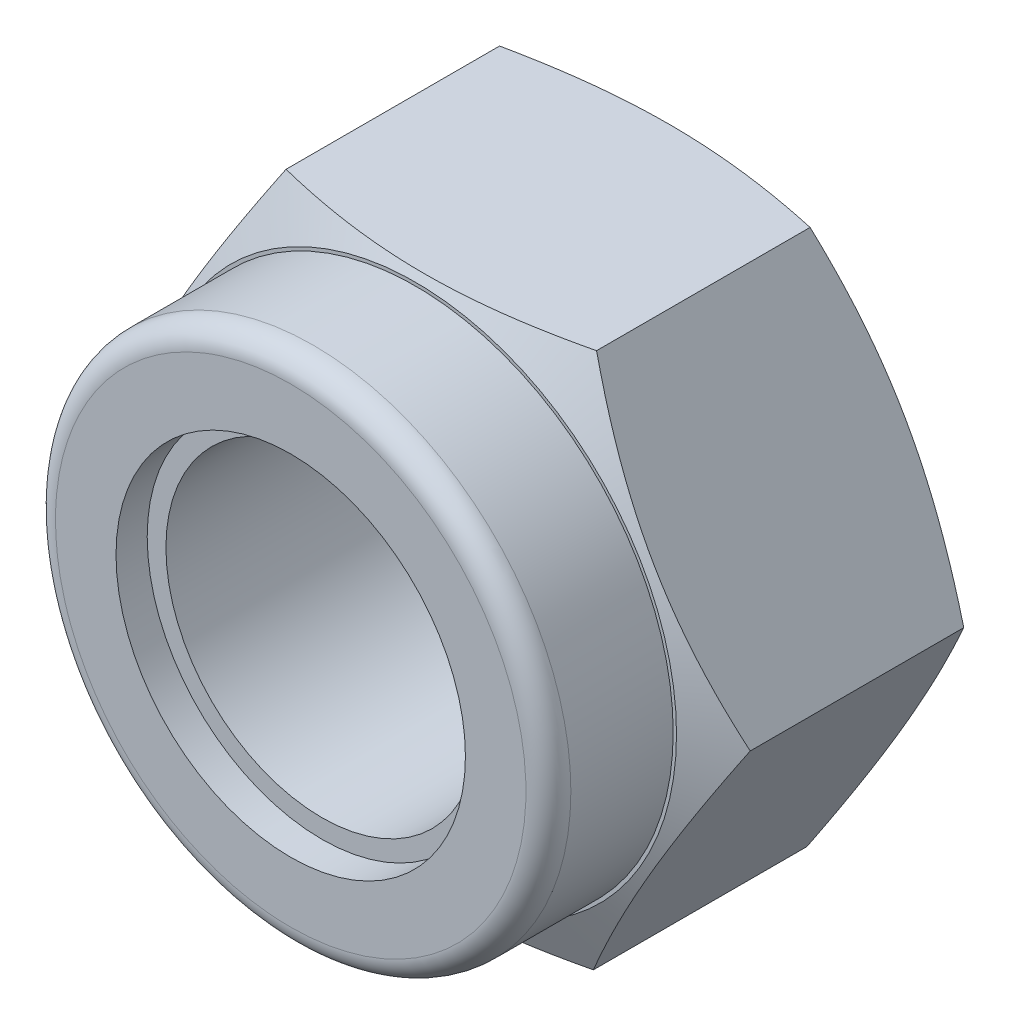
ISO-10303-21;
HEADER;
FILE_DESCRIPTION(('STEP AP214'),'2;1');
FILE_NAME('part.step','',(''),(''),'','','');
FILE_SCHEMA(('AUTOMOTIVE_DESIGN { 1 0 10303 214 1 1 1 1 }'));
ENDSEC;
DATA;
#1=APPLICATION_CONTEXT('core data for automotive mechanical design processes');
#2=APPLICATION_PROTOCOL_DEFINITION('international standard','automotive_design',2000,#1);
#3=PRODUCT_CONTEXT('',#1,'mechanical');
#4=PRODUCT('Part','Part','',(#3));
#5=PRODUCT_RELATED_PRODUCT_CATEGORY('part','',(#4));
#6=PRODUCT_DEFINITION_FORMATION('','',#4);
#7=PRODUCT_DEFINITION_CONTEXT('part definition',#1,'design');
#8=PRODUCT_DEFINITION('design','',#6,#7);
#9=PRODUCT_DEFINITION_SHAPE('','',#8);
#10=(LENGTH_UNIT() NAMED_UNIT(*) SI_UNIT(.MILLI.,.METRE.));
#11=(NAMED_UNIT(*) PLANE_ANGLE_UNIT() SI_UNIT($,.RADIAN.));
#12=(NAMED_UNIT(*) SI_UNIT($,.STERADIAN.) SOLID_ANGLE_UNIT());
#13=UNCERTAINTY_MEASURE_WITH_UNIT(LENGTH_MEASURE(1.E-05),#10,'distance_accuracy_value','');
#14=(GEOMETRIC_REPRESENTATION_CONTEXT(3) GLOBAL_UNCERTAINTY_ASSIGNED_CONTEXT((#13)) GLOBAL_UNIT_ASSIGNED_CONTEXT((#10,
#11,#12)) REPRESENTATION_CONTEXT('',''));
#15=CARTESIAN_POINT('',(0.,0.,0.));
#16=DIRECTION('',(0.,0.,1.));
#17=DIRECTION('',(1.,0.,0.));
#18=AXIS2_PLACEMENT_3D('',#15,#16,#17);
#19=CARTESIAN_POINT('',(0.,0.,5.334));
#20=DIRECTION('',(0.,0.,1.));
#21=DIRECTION('',(1.,0.,0.));
#22=AXIS2_PLACEMENT_3D('',#19,#20,#21);
#23=PLANE('',#22);
#24=CARTESIAN_POINT('',(0.,0.,5.33400000000736));
#25=DIRECTION('',(0.,0.,-1.));
#26=DIRECTION('',(-1.,0.,0.));
#27=AXIS2_PLACEMENT_3D('',#24,#25,#26);
#28=CIRCLE('',#27,5.31273775635555);
#29=CARTESIAN_POINT('',(-5.31273775635555,0.,5.33400000000736));
#30=VERTEX_POINT('',#29);
#31=EDGE_CURVE('E282',#30,#30,#28,.T.);
#32=ORIENTED_EDGE('',*,*,#31,.F.);
#33=EDGE_LOOP('',(#32));
#34=FACE_BOUND('',#33,.T.);
#35=CARTESIAN_POINT('',(0.,0.,5.334));
#36=DIRECTION('',(0.,0.,1.));
#37=DIRECTION('',(1.,0.,0.));
#38=AXIS2_PLACEMENT_3D('',#35,#36,#37);
#39=CIRCLE('',#38,5.2451);
#40=CARTESIAN_POINT('',(5.2451,0.,5.334));
#41=VERTEX_POINT('',#40);
#42=EDGE_CURVE('E21',#41,#41,#39,.T.);
#43=ORIENTED_EDGE('',*,*,#42,.F.);
#44=EDGE_LOOP('',(#43));
#45=FACE_BOUND('',#44,.T.);
#46=ADVANCED_FACE('F17',(#34,#45),#23,.T.);
#47=CARTESIAN_POINT('',(0.,0.,5.334));
#48=DIRECTION('',(0.,0.,1.));
#49=DIRECTION('',(1.,0.,0.));
#50=AXIS2_PLACEMENT_3D('',#47,#48,#49);
#51=CYLINDRICAL_SURFACE('',#50,5.2451);
#52=ORIENTED_EDGE('',*,*,#42,.T.);
#53=EDGE_LOOP('',(#52));
#54=FACE_BOUND('',#53,.T.);
#55=CARTESIAN_POINT('',(0.,0.,7.4168));
#56=DIRECTION('',(0.,0.,1.));
#57=DIRECTION('',(1.,0.,0.));
#58=AXIS2_PLACEMENT_3D('',#55,#56,#57);
#59=CIRCLE('',#58,5.2451);
#60=CARTESIAN_POINT('',(5.2451,0.,7.4168));
#61=VERTEX_POINT('',#60);
#62=EDGE_CURVE('E86',#61,#61,#59,.T.);
#63=ORIENTED_EDGE('',*,*,#62,.F.);
#64=EDGE_LOOP('',(#63));
#65=FACE_BOUND('',#64,.T.);
#66=ADVANCED_FACE('F119',(#54,#65),#51,.T.);
#67=CARTESIAN_POINT('',(0.,0.,4.83836780344404));
#68=DIRECTION('',(0.,0.,-1.));
#69=DIRECTION('',(-1.,0.,0.));
#70=AXIS2_PLACEMENT_3D('',#67,#68,#69);
#71=CONICAL_SURFACE('',#70,6.3265308160112,1.11607702485432);
#72=CARTESIAN_POINT('',(6.32037506594794,-0.0371655629206129,4.84132386008899));
#73=CARTESIAN_POINT('',(6.22833366151809,-0.19444286281713,4.8858660135372));
#74=CARTESIAN_POINT('',(6.13593989417938,-0.352322268768321,4.92769627799901));
#75=CARTESIAN_POINT('',(5.95043037166558,-0.669314789545201,5.00501655106751));
#76=CARTESIAN_POINT('',(5.85731426499188,-0.828428505000025,5.04050324073664));
#77=CARTESIAN_POINT('',(5.67031652629657,-1.14796404024023,5.10421314817306));
#78=CARTESIAN_POINT('',(5.57643405141017,-1.30838730028498,5.1324267923882));
#79=CARTESIAN_POINT('',(5.38814286869859,-1.63013302977098,5.18062149325364));
#80=CARTESIAN_POINT('',(5.29373425705883,-1.79145533485376,5.20060400767163));
#81=CARTESIAN_POINT('',(5.10662322282933,-2.11118446574603,5.23126731054475));
#82=CARTESIAN_POINT('',(5.01392905247022,-2.26957719041745,5.24214339050006));
#83=CARTESIAN_POINT('',(4.82837594477426,-2.58664418810835,5.25490604687276));
#84=CARTESIAN_POINT('',(4.73551699905818,-2.74531847544599,5.25679215221227));
#85=CARTESIAN_POINT('',(4.54996186341723,-3.06238893842205,5.25150045578435));
#86=CARTESIAN_POINT('',(4.4572656043928,-3.2207852321355,5.24433199570822));
#87=CARTESIAN_POINT('',(4.27216288236742,-3.53708262572682,5.22123078858181));
#88=CARTESIAN_POINT('',(4.17975639476994,-3.69498376763441,5.20529880682979));
#89=CARTESIAN_POINT('',(4.00714250371091,-3.98994066098654,5.16780955551947));
#90=CARTESIAN_POINT('',(3.92688014289494,-4.12709032173596,5.14722700506324));
#91=CARTESIAN_POINT('',(3.76677978044193,-4.40066451234116,5.10035283174324));
#92=CARTESIAN_POINT('',(3.68694180089308,-4.53708900445337,5.0740609146422));
#93=CARTESIAN_POINT('',(3.5269404443261,-4.81049401708344,5.01605322972002));
#94=CARTESIAN_POINT('',(3.44678193376816,-4.94746622195552,4.9842853299852));
#95=CARTESIAN_POINT('',(3.28699660715654,-5.22050208976119,4.91612438552128));
#96=CARTESIAN_POINT('',(3.20736961164292,-5.35656605935,4.87973299465746));
#97=CARTESIAN_POINT('',(3.12800121134054,-5.49218815001656,4.84132386008874));
#98=B_SPLINE_CURVE_WITH_KNOTS('',3,(#72,#73,#74,#75,#76,#77,#78,#79,#80,#81,#82,#83,#84,#85,#86,
#87,#88,#89,#90,#91,#92,#93,#94,#95,#96,#97),.UNSPECIFIED.,.F.,.F.,(4,2,2,2,2,2,2,2,2,2,2,2,4),
(0.,0.562813868194877,1.12592134237628,1.68976629638556,2.2535113481042,2.80483224896724,
3.35618203892448,3.90696345979255,4.45769678981567,4.93829687717906,5.41892173857439,
5.90440415872453,6.38971340373801),.UNSPECIFIED.);
#99=CARTESIAN_POINT('',(6.3203750659453,-0.0371655629146358,4.8413238600903));
#100=VERTEX_POINT('',#99);
#101=CARTESIAN_POINT('',(3.12800122281629,-5.49218815008425,4.84132385728342));
#102=VERTEX_POINT('',#101);
#103=EDGE_CURVE('E74',#100,#102,#98,.T.);
#104=ORIENTED_EDGE('',*,*,#103,.F.);
#105=CARTESIAN_POINT('',(3.19237385460845,5.45502258709762,4.84132386008864));
#106=CARTESIAN_POINT('',(3.28208512918141,5.29750628008782,4.88563179788484));
#107=CARTESIAN_POINT('',(3.37213784296513,5.13939046935004,4.92725624998518));
#108=CARTESIAN_POINT('',(3.55294266570987,4.82193084006841,5.00423596484944));
#109=CARTESIAN_POINT('',(3.64369510847837,4.66258643542072,5.0395880139036));
#110=CARTESIAN_POINT('',(3.8259485291596,4.34258333768004,5.10311689041716));
#111=CARTESIAN_POINT('',(3.91745035997898,4.18192314704165,5.13128385422299));
#112=CARTESIAN_POINT('',(4.1009666015464,3.85970277077768,5.17948424190754));
#113=CARTESIAN_POINT('',(4.19298092192724,3.69814274382008,5.19951905640176));
#114=CARTESIAN_POINT('',(4.3763064177163,3.3762572816539,5.23055252558859));
#115=CARTESIAN_POINT('',(4.46761329058068,3.21593940091178,5.24165376667182));
#116=CARTESIAN_POINT('',(4.65039373436749,2.89501094865245,5.25477402327016));
#117=CARTESIAN_POINT('',(4.74186731391235,2.73440036199585,5.25679255485539));
#118=CARTESIAN_POINT('',(4.92465602509764,2.41345739372297,5.25166678488675));
#119=CARTESIAN_POINT('',(5.01597122281918,2.25312489608054,5.24453194191376));
#120=CARTESIAN_POINT('',(5.19831553759308,1.93296220522435,5.2214010893566));
#121=CARTESIAN_POINT('',(5.2893446796386,1.77313196812721,5.20540587686116));
#122=CARTESIAN_POINT('',(5.45755507746106,1.47778580576614,5.16812128791714));
#123=CARTESIAN_POINT('',(5.53479875100708,1.34216028651277,5.14796055986878));
#124=CARTESIAN_POINT('',(5.68888070460646,1.07162104355403,5.10212452056477));
#125=CARTESIAN_POINT('',(5.76571899315048,0.936707304940669,5.07644932528127));
#126=CARTESIAN_POINT('',(5.91894129525481,0.667677450065663,5.02012897810935));
#127=CARTESIAN_POINT('',(5.99532532753603,0.533561300933592,4.98948403252753));
#128=CARTESIAN_POINT('',(6.14762095713527,0.266158510566403,4.9237807036753));
#129=CARTESIAN_POINT('',(6.22353258486393,0.13287181593588,4.88872260764732));
#130=CARTESIAN_POINT('',(6.30626569398043,-0.0123921308479018,4.84827518686258));
#131=CARTESIAN_POINT('',(6.31332140864244,-0.0247806530505442,4.84480784669621));
#132=CARTESIAN_POINT('',(6.32037506594266,-0.0371655629086588,4.84132386009161));
#133=B_SPLINE_CURVE_WITH_KNOTS('',3,(#105,#106,#107,#108,#109,#110,#111,#112,#113,#114,#115,
#116,#117,#118,#119,#120,#121,#122,#123,#124,#125,#126,#127,#128,#129,#130,#131,#132),
.UNSPECIFIED.,.F.,.F.,(4,2,2,2,2,2,2,2,2,2,2,2,2,4),(0.,0.55985412939021,1.11999428081796,
1.68089930141867,2.24170836557184,2.79598175912566,3.35028468420697,3.90401528500992,
4.45769607967872,4.92972204239881,5.4017380791355,5.87373452633379,6.34570026817044,
6.38971758818025),.UNSPECIFIED.);
#134=CARTESIAN_POINT('',(3.19237385707062,5.45502258277493,4.8413238613046));
#135=VERTEX_POINT('',#134);
#136=EDGE_CURVE('E127',#135,#100,#133,.T.);
#137=ORIENTED_EDGE('',*,*,#136,.F.);
#138=CARTESIAN_POINT('',(-3.12800121134198,5.49218815001699,4.84132386008821));
#139=CARTESIAN_POINT('',(-2.94577437197797,5.49111660552899,4.88586601353647));
#140=CARTESIAN_POINT('',(-2.76284991202042,5.49004095883792,4.92769627799833));
#141=CARTESIAN_POINT('',(-2.39557157496093,5.48788126008548,5.00501655106693));
#142=CARTESIAN_POINT('',(-2.21121700194961,5.48679720393198,5.04050324073611));
#143=CARTESIAN_POINT('',(-1.84099224167192,5.48462017939169,5.10421314817263));
#144=CARTESIAN_POINT('',(-1.65512038567198,5.48352720119229,5.13242679238782));
#145=CARTESIAN_POINT('',(-1.28233481902201,5.48133511839845,5.18062149325336));
#146=CARTESIAN_POINT('',(-1.09542129880329,5.48023601492378,5.2006040076714));
#147=CARTESIAN_POINT('',(-0.724972232005771,5.47805767139879,5.2312673105446));
#148=CARTESIAN_POINT('',(-0.541453023486053,5.47697852742078,5.24214339049995));
#149=CARTESIAN_POINT('',(-0.174088394935942,5.47481832125039,5.25490604687272));
#150=CARTESIAN_POINT('',(0.00975704168396752,5.47373725896044,5.25679215221226));
#151=CARTESIAN_POINT('',(0.37712568523155,5.47157702918074,5.25150045578441));
#152=CARTESIAN_POINT('',(0.560649028964985,5.47049786088653,5.2443319957083));
#153=CARTESIAN_POINT('',(0.927121967978725,5.46834289809856,5.22123078858194));
#154=CARTESIAN_POINT('',(1.11007161195609,5.46726710331844,5.20529880682994));
#155=CARTESIAN_POINT('',(1.45181872015016,5.4652575352913,5.16780955551962));
#156=CARTESIAN_POINT('',(1.61072499088775,5.46432312223167,5.14722700506338));
#157=CARTESIAN_POINT('',(1.92769737099852,5.46245923649487,5.10035283174334));
#158=CARTESIAN_POINT('',(2.08576343664071,5.46152976407484,5.07406091464228));
#159=CARTESIAN_POINT('',(2.40253980138424,5.4596670309629,5.01605322972003));
#160=CARTESIAN_POINT('',(2.56124046569499,5.45873382692624,4.98428532998516));
#161=CARTESIAN_POINT('',(2.87758912666524,5.45687360883142,4.91612438552116));
#162=CARTESIAN_POINT('',(3.0352374786259,5.45594659268399,4.87973299465728));
#163=CARTESIAN_POINT('',(3.19237385460888,5.45502258709768,4.8413238600885));
#164=B_SPLINE_CURVE_WITH_KNOTS('',3,(#138,#139,#140,#141,#142,#143,#144,#145,#146,#147,#148,
#149,#150,#151,#152,#153,#154,#155,#156,#157,#158,#159,#160,#161,#162,#163),.UNSPECIFIED.,.F.,
.F.,(4,2,2,2,2,2,2,2,2,2,2,2,4),(0.,0.56281386819512,1.12592134237677,1.68976629638629,
2.25351134810518,2.80483224896845,3.35618203892592,3.90696345979422,4.45769678981757,
4.93829687718154,5.41892173857746,5.90440415872821,6.3897134037423),.UNSPECIFIED.);
#165=CARTESIAN_POINT('',(-3.12800122281598,5.49218815008425,4.84132385728349));
#166=VERTEX_POINT('',#165);
#167=EDGE_CURVE('E134',#166,#135,#164,.T.);
#168=ORIENTED_EDGE('',*,*,#167,.F.);
#169=CARTESIAN_POINT('',(-6.32037506594956,0.0371655629178402,4.84132386008821));
#170=CARTESIAN_POINT('',(-6.22833366151967,0.194442862814418,4.88586601353647));
#171=CARTESIAN_POINT('',(-6.13593989418093,0.352322268765671,4.92769627799833));
#172=CARTESIAN_POINT('',(-5.95043037166705,0.669314789542675,5.00501655106693));
#173=CARTESIAN_POINT('',(-5.85731426499332,0.828428504997562,5.04050324073611));
#174=CARTESIAN_POINT('',(-5.67031652629793,1.1479640402379,5.10421314817263));
#175=CARTESIAN_POINT('',(-5.5764340514115,1.30838730028271,5.13242679238782));
#176=CARTESIAN_POINT('',(-5.38814286869984,1.63013302976884,5.18062149325336));
#177=CARTESIAN_POINT('',(-5.29373425706004,1.79145533485169,5.2006040076714));
#178=CARTESIAN_POINT('',(-5.10662322283046,2.11118446574409,5.2312673105446));
#179=CARTESIAN_POINT('',(-5.01392905247131,2.26957719041558,5.24214339049995));
#180=CARTESIAN_POINT('',(-4.82837594477528,2.58664418810661,5.25490604687272));
#181=CARTESIAN_POINT('',(-4.73551699905915,2.74531847544432,5.25679215221226));
#182=CARTESIAN_POINT('',(-4.54996186341813,3.0623889384205,5.25150045578441));
#183=CARTESIAN_POINT('',(-4.45726560439367,3.22078523213402,5.2443319957083));
#184=CARTESIAN_POINT('',(-4.27216288236821,3.53708262572548,5.22123078858194));
#185=CARTESIAN_POINT('',(-4.17975639477069,3.69498376763314,5.20529880682994));
#186=CARTESIAN_POINT('',(-4.00714250371156,3.98994066098543,5.16780955551963));
#187=CARTESIAN_POINT('',(-3.92688014289553,4.12709032173495,5.1472270050634));
#188=CARTESIAN_POINT('',(-3.7667797804424,4.40066451234036,5.10035283174339));
#189=CARTESIAN_POINT('',(-3.68694180089349,4.53708900445266,5.07406091464234));
#190=CARTESIAN_POINT('',(-3.5269404443264,4.81049401708294,5.01605322972014));
#191=CARTESIAN_POINT('',(-3.44678193376839,4.94746622195512,4.98428532998529));
#192=CARTESIAN_POINT('',(-3.28699660715666,5.22050208976099,4.91612438552134));
#193=CARTESIAN_POINT('',(-3.20736961164298,5.3565660593499,4.87973299465749));
#194=CARTESIAN_POINT('',(-3.12800121134054,5.49218815001656,4.84132386008874));
#195=B_SPLINE_CURVE_WITH_KNOTS('',3,(#169,#170,#171,#172,#173,#174,#175,#176,#177,#178,#179,
#180,#181,#182,#183,#184,#185,#186,#187,#188,#189,#190,#191,#192,#193,#194),.UNSPECIFIED.,.F.,
.F.,(4,2,2,2,2,2,2,2,2,2,2,2,4),(0.,0.56281386819512,1.12592134237677,1.6897662963863,
2.25351134810518,2.80483224896845,3.35618203892592,3.90696345979422,4.45769678981757,
4.9382968771813,5.41892173857698,5.90440415872747,6.38971340374132),.UNSPECIFIED.);
#196=CARTESIAN_POINT('',(-6.32037507174721,0.0371655530104973,4.84132385728233));
#197=VERTEX_POINT('',#196);
#198=EDGE_CURVE('E141',#197,#166,#195,.T.);
#199=ORIENTED_EDGE('',*,*,#198,.F.);
#200=CARTESIAN_POINT('',(-3.19237385460758,-5.45502258709915,4.84132386008821));
#201=CARTESIAN_POINT('',(-3.28208512918056,-5.29750628008931,4.88563179788444));
#202=CARTESIAN_POINT('',(-3.3721378429643,-5.13939046935149,4.92725624998481));
#203=CARTESIAN_POINT('',(-3.55294266570909,-4.82193084006978,5.00423596484913));
#204=CARTESIAN_POINT('',(-3.64369510847761,-4.66258643542207,5.03958801390332));
#205=CARTESIAN_POINT('',(-3.82594852915888,-4.34258333768131,5.10311689041693));
#206=CARTESIAN_POINT('',(-3.91745035997828,-4.18192314704288,5.13128385422278));
#207=CARTESIAN_POINT('',(-4.10096660154574,-3.85970277077883,5.17948424190739));
#208=CARTESIAN_POINT('',(-4.19298092192661,-3.69814274382119,5.19951905640164));
#209=CARTESIAN_POINT('',(-4.3763064177157,-3.37625728165494,5.23055252558851));
#210=CARTESIAN_POINT('',(-4.4676132905801,-3.21593940091279,5.24165376667176));
#211=CARTESIAN_POINT('',(-4.65039373436695,-2.89501094865339,5.25477402327014));
#212=CARTESIAN_POINT('',(-4.74186731391183,-2.73440036199675,5.25679255485539));
#213=CARTESIAN_POINT('',(-4.92465602509716,-2.41345739372381,5.25166678488678));
#214=CARTESIAN_POINT('',(-5.01597122281873,-2.25312489608134,5.2445319419138));
#215=CARTESIAN_POINT('',(-5.19831553759266,-1.93296220522508,5.22140108935667));
#216=CARTESIAN_POINT('',(-5.28934467963821,-1.77313196812791,5.20540587686124));
#217=CARTESIAN_POINT('',(-5.45755507746104,-1.47778580576617,5.16812128791715));
#218=CARTESIAN_POINT('',(-5.53479875100741,-1.34216028651217,5.1479605598687));
#219=CARTESIAN_POINT('',(-5.68888070460751,-1.0716210435522,5.10212452056444));
#220=CARTESIAN_POINT('',(-5.76571899315188,-0.936707304938216,5.07644932528079));
#221=CARTESIAN_POINT('',(-5.91894129525691,-0.667677450061981,5.02012897810854));
#222=CARTESIAN_POINT('',(-5.99532532753847,-0.5335613009293,4.98948403252653));
#223=CARTESIAN_POINT('',(-6.14762095713841,-0.266158510560896,4.92378070367389));
#224=CARTESIAN_POINT('',(-6.2235325848674,-0.132871815929769,4.88872260764569));
#225=CARTESIAN_POINT('',(-6.3062656939849,0.0123921308557474,4.84827518686039));
#226=CARTESIAN_POINT('',(-6.31332140864756,0.0247806530595255,4.84480784669369));
#227=CARTESIAN_POINT('',(-6.32037506594842,0.0371655629187751,4.84132386008877));
#228=B_SPLINE_CURVE_WITH_KNOTS('',3,(#200,#201,#202,#203,#204,#205,#206,#207,#208,#209,#210,
#211,#212,#213,#214,#215,#216,#217,#218,#219,#220,#221,#222,#223,#224,#225,#226,#227),
.UNSPECIFIED.,.F.,.F.,(4,2,2,2,2,2,2,2,2,2,2,2,2,4),(0.,0.559854129390351,1.11999428081824,
1.6808993014191,2.24170836557241,2.79598175912635,3.35028468420777,3.90401528501084,
4.45769607967976,4.92972204240202,5.40173807914089,5.87373452634136,6.34570026818019,
6.38971758819405),.UNSPECIFIED.);
#229=CARTESIAN_POINT('',(-3.19237384892808,-5.45502259707088,4.84132385728312));
#230=VERTEX_POINT('',#229);
#231=EDGE_CURVE('E94',#230,#197,#228,.T.);
#232=ORIENTED_EDGE('',*,*,#231,.F.);
#233=CARTESIAN_POINT('',(3.12800121134198,-5.49218815001699,4.84132386008821));
#234=CARTESIAN_POINT('',(2.94577437197798,-5.491116605529,4.88586601353647));
#235=CARTESIAN_POINT('',(2.76284991202042,-5.49004095883792,4.92769627799833));
#236=CARTESIAN_POINT('',(2.39557157496093,-5.48788126008548,5.00501655106693));
#237=CARTESIAN_POINT('',(2.21121700194961,-5.48679720393198,5.04050324073611));
#238=CARTESIAN_POINT('',(1.84099224167193,-5.48462017939169,5.10421314817263));
#239=CARTESIAN_POINT('',(1.65512038567198,-5.4835272011923,5.13242679238782));
#240=CARTESIAN_POINT('',(1.28233481902201,-5.48133511839845,5.18062149325336));
#241=CARTESIAN_POINT('',(1.09542129880329,-5.48023601492378,5.20060400767139));
#242=CARTESIAN_POINT('',(0.724972232005771,-5.47805767139879,5.2312673105446));
#243=CARTESIAN_POINT('',(0.541453023486052,-5.47697852742079,5.24214339049995));
#244=CARTESIAN_POINT('',(0.17408839493594,-5.47481832125039,5.25490604687272));
#245=CARTESIAN_POINT('',(-0.0097570416839691,-5.47373725896044,5.25679215221226));
#246=CARTESIAN_POINT('',(-0.377125685231552,-5.47157702918074,5.25150045578441));
#247=CARTESIAN_POINT('',(-0.560649028964987,-5.47049786088653,5.2443319957083));
#248=CARTESIAN_POINT('',(-0.927121967978728,-5.46834289809856,5.22123078858194));
#249=CARTESIAN_POINT('',(-1.11007161195609,-5.46726710331844,5.20529880682994));
#250=CARTESIAN_POINT('',(-1.45181872015008,-5.4652575352913,5.16780955551963));
#251=CARTESIAN_POINT('',(-1.6107249908876,-5.46432312223168,5.1472270050634));
#252=CARTESIAN_POINT('',(-1.92769737099821,-5.46245923649487,5.10035283174339));
#253=CARTESIAN_POINT('',(-2.08576343664031,-5.46152976407484,5.07406091464234));
#254=CARTESIAN_POINT('',(-2.40253980138368,-5.45966703096291,5.01605322972014));
#255=CARTESIAN_POINT('',(-2.56124046569435,-5.45873382692624,4.98428532998529));
#256=CARTESIAN_POINT('',(-2.87758912666444,-5.45687360883142,4.91612438552134));
#257=CARTESIAN_POINT('',(-3.03523747862502,-5.455946592684,4.87973299465749));
#258=CARTESIAN_POINT('',(-3.19237385460793,-5.45502258709769,4.84132386008874));
#259=B_SPLINE_CURVE_WITH_KNOTS('',3,(#233,#234,#235,#236,#237,#238,#239,#240,#241,#242,#243,
#244,#245,#246,#247,#248,#249,#250,#251,#252,#253,#254,#255,#256,#257,#258),.UNSPECIFIED.,.F.,
.F.,(4,2,2,2,2,2,2,2,2,2,2,2,4),(0.,0.56281386819512,1.12592134237677,1.68976629638629,
2.25351134810518,2.80483224896845,3.35618203892592,3.90696345979422,4.45769678981757,
4.9382968771813,5.41892173857698,5.90440415872747,6.38971340374131),.UNSPECIFIED.);
#260=EDGE_CURVE('E85',#102,#230,#259,.T.);
#261=ORIENTED_EDGE('',*,*,#260,.F.);
#262=EDGE_LOOP('',(#104,#137,#168,#199,#232,#261));
#263=FACE_BOUND('',#262,.T.);
#264=ORIENTED_EDGE('',*,*,#31,.T.);
#265=EDGE_LOOP('',(#264));
#266=FACE_BOUND('',#265,.T.);
#267=ADVANCED_FACE('F96',(#263,#266),#71,.T.);
#268=CARTESIAN_POINT('',(0.,0.,7.4168));
#269=DIRECTION('',(0.,0.,-1.));
#270=DIRECTION('',(-1.,0.,0.));
#271=AXIS2_PLACEMENT_3D('',#268,#269,#270);
#272=TOROIDAL_SURFACE('',#271,4.7879,0.4572);
#273=ORIENTED_EDGE('',*,*,#62,.T.);
#274=EDGE_LOOP('',(#273));
#275=FACE_BOUND('',#274,.T.);
#276=CARTESIAN_POINT('',(0.,4.7879,7.874));
#277=CARTESIAN_POINT('',(-0.912507970637655,4.78800107826667,7.874));
#278=CARTESIAN_POINT('',(-1.7624006599113,4.45173340665681,7.874));
#279=CARTESIAN_POINT('',(-2.21282144880202,4.27352037831036,7.874));
#280=CARTESIAN_POINT('',(-2.61998557823273,4.00745080816378,7.874));
#281=CARTESIAN_POINT('',(-3.03415135893962,3.73680586850226,7.874));
#282=CARTESIAN_POINT('',(-3.38555655764307,3.38555655764307,7.874));
#283=CARTESIAN_POINT('',(-3.73546696528567,3.03580137473629,7.874));
#284=CARTESIAN_POINT('',(-4.00745080816377,2.61998557823273,7.874));
#285=CARTESIAN_POINT('',(-4.27255727958396,2.21468408162421,7.874));
#286=CARTESIAN_POINT('',(-4.4517334066568,1.7624006599113,7.874));
#287=CARTESIAN_POINT('',(-4.78770071533789,0.9143387755723,7.874));
#288=CARTESIAN_POINT('',(-4.7879,0.,7.874));
#289=CARTESIAN_POINT('',(-4.78809883178006,-0.912260905566992,7.874));
#290=CARTESIAN_POINT('',(-4.4517334066568,-1.7624006599113,7.874));
#291=CARTESIAN_POINT('',(-4.27352037830815,-2.21282144880707,7.874));
#292=CARTESIAN_POINT('',(-4.00745080816377,-2.61998557823274,7.874));
#293=CARTESIAN_POINT('',(-3.7368058684979,-3.03415135894459,7.874));
#294=CARTESIAN_POINT('',(-3.38555655764306,-3.38555655764308,7.874));
#295=CARTESIAN_POINT('',(-3.03580137473736,-3.73546696528398,7.874));
#296=CARTESIAN_POINT('',(-2.61998557823271,-4.00745080816379,7.874));
#297=CARTESIAN_POINT('',(-2.214684081631,-4.27255727958048,7.874));
#298=CARTESIAN_POINT('',(-1.76240065991129,-4.45173340665681,7.874));
#299=CARTESIAN_POINT('',(-0.914091321852844,-4.78779874634594,7.874));
#300=CARTESIAN_POINT('',(0.,-4.7879,7.874));
#301=B_SPLINE_CURVE_WITH_KNOTS('',2,(#276,#277,#278,#279,#280,#281,#282,#283,#284,#285,#286,
#287,#288,#289,#290,#291,#292,#293,#294,#295,#296,#297,#298,#299,#300),.UNSPECIFIED.,.F.,.F.,(3,
2,2,2,2,2,2,2,2,2,2,2,3),(0.,0.125,0.1875,0.25,0.3125,0.375,0.5,0.625,0.6875,0.75,0.8125,0.875,
1.),.UNSPECIFIED.);
#302=CARTESIAN_POINT('',(0.,4.7879,7.874));
#303=VERTEX_POINT('',#302);
#304=CARTESIAN_POINT('',(0.,-4.7879,7.874));
#305=VERTEX_POINT('',#304);
#306=EDGE_CURVE('E262',#303,#305,#301,.T.);
#307=ORIENTED_EDGE('',*,*,#306,.F.);
#308=CARTESIAN_POINT('',(0.,0.,7.874));
#309=DIRECTION('',(0.,0.,-1.));
#310=DIRECTION('',(-1.,0.,0.));
#311=AXIS2_PLACEMENT_3D('',#308,#309,#310);
#312=CIRCLE('',#311,4.7879);
#313=EDGE_CURVE('E263',#305,#303,#312,.F.);
#314=ORIENTED_EDGE('',*,*,#313,.F.);
#315=EDGE_LOOP('',(#307,#314));
#316=FACE_BOUND('',#315,.T.);
#317=ADVANCED_FACE('F19',(#275,#316),#272,.T.);
#318=CARTESIAN_POINT('',(6.32037506594871,-0.0371655629192953,0.));
#319=DIRECTION('',(0.863070343395602,-0.505083737959358,0.));
#320=DIRECTION('',(0.505083737959358,0.863070343395602,0.));
#321=AXIS2_PLACEMENT_3D('',#318,#319,#320);
#322=PLANE('',#321);
#323=CARTESIAN_POINT('',(6.32037502985006,-0.0371654459643939,0.49495993962358));
#324=CARTESIAN_POINT('',(6.21595254922659,-0.215599232787237,0.450368281543948));
#325=CARTESIAN_POINT('',(6.11116742702291,-0.394652622018415,0.408901016145712));
#326=CARTESIAN_POINT('',(5.90086249945405,-0.754014743171803,0.333349470541661));
#327=CARTESIAN_POINT('',(5.79534231202103,-0.934324127925177,0.299269380046743));
#328=CARTESIAN_POINT('',(5.5836463007788,-1.29606324310159,0.239671060506125));
#329=CARTESIAN_POINT('',(5.47747030068677,-1.47749327475536,0.214155245517185));
#330=CARTESIAN_POINT('',(5.26465625223767,-1.84114286653184,0.172749422188399));
#331=CARTESIAN_POINT('',(5.1580183031682,-2.02336225699609,0.156857439621324));
#332=CARTESIAN_POINT('',(4.9464654976336,-2.38485667558204,0.135632320851297));
#333=CARTESIAN_POINT('',(4.84155560760613,-2.56412321719835,0.130107740976537));
#334=CARTESIAN_POINT('',(4.6317176050926,-2.9226874380652,0.129300758661452));
#335=CARTESIAN_POINT('',(4.52678949183353,-3.10198511863662,0.13401911056459));
#336=CARTESIAN_POINT('',(4.31725526842711,-3.46003025161962,0.153463378695621));
#337=CARTESIAN_POINT('',(4.21264897279512,-3.63877802098118,0.168181601635434));
#338=CARTESIAN_POINT('',(4.00389207635088,-3.99549488348476,0.206949810762892));
#339=CARTESIAN_POINT('',(3.89974143292936,-4.1734640494361,0.230998904680507));
#340=CARTESIAN_POINT('',(3.74000861238008,-4.44641019662172,0.274420805207881));
#341=CARTESIAN_POINT('',(3.68421435964086,-4.54174956562599,0.290822311011308));
#342=CARTESIAN_POINT('',(3.57281346288463,-4.73210772407037,0.325876668715684));
#343=CARTESIAN_POINT('',(3.51720679518185,-4.82712655398393,0.344529224541546));
#344=CARTESIAN_POINT('',(3.40588754576298,-5.01734519616513,0.384021503684979));
#345=CARTESIAN_POINT('',(3.35017597495109,-5.11254328103321,0.404872337132735));
#346=CARTESIAN_POINT('',(3.23894418645349,-5.3026124728924,0.448508257005031));
#347=CARTESIAN_POINT('',(3.18342397536334,-5.39748356861324,0.471293409419105));
#348=CARTESIAN_POINT('',(3.12800127426777,-5.49218804248861,0.494959830355336));
#349=B_SPLINE_CURVE_WITH_KNOTS('',3,(#323,#324,#325,#326,#327,#328,#329,#330,#331,#332,#333,
#334,#335,#336,#337,#338,#339,#340,#341,#342,#343,#344,#345,#346,#347,#348),.UNSPECIFIED.,.F.,
.F.,(4,2,2,2,2,2,2,2,2,2,2,2,4),(0.,0.634532172801817,1.26942329071488,1.90449321868397,
2.53943282461717,3.16252769933765,3.78566846360438,4.40833036358988,5.03093273583368,
5.36594211654617,5.70090748222071,6.03765525293353,6.374414516459),.UNSPECIFIED.);
#350=CARTESIAN_POINT('',(6.32037501295764,-0.0371654698768281,0.494959834132793));
#351=VERTEX_POINT('',#350);
#352=CARTESIAN_POINT('',(3.1280012542799,-5.49218809632028,0.494959846266548));
#353=VERTEX_POINT('',#352);
#354=EDGE_CURVE('E188',#351,#353,#349,.T.);
#355=ORIENTED_EDGE('',*,*,#354,.F.);
#356=DIRECTION('',(0.,0.,1.));
#357=VECTOR('',#356,1.);
#358=CARTESIAN_POINT('',(6.32037506594758,-0.0371655629173,0.));
#359=LINE('',#358,#357);
#360=EDGE_CURVE('E81',#100,#351,#359,.F.);
#361=ORIENTED_EDGE('',*,*,#360,.F.);
#362=ORIENTED_EDGE('',*,*,#103,.T.);
#363=DIRECTION('',(0.,0.,1.));
#364=VECTOR('',#363,1.);
#365=CARTESIAN_POINT('',(3.12800123429203,-5.49218815015194,0.));
#366=LINE('',#365,#364);
#367=EDGE_CURVE('E78',#353,#102,#366,.T.);
#368=ORIENTED_EDGE('',*,*,#367,.F.);
#369=EDGE_LOOP('',(#355,#361,#362,#368));
#370=FACE_BOUND('',#369,.T.);
#371=ADVANCED_FACE('F77',(#370),#322,.T.);
#372=CARTESIAN_POINT('',(3.1280012113403,-5.49218815001698,0.));
#373=DIRECTION('',(-0.00588017641340522,-0.999982711613229,0.));
#374=DIRECTION('',(0.999982711613229,-0.00588017641340522,0.));
#375=AXIS2_PLACEMENT_3D('',#372,#373,#374);
#376=PLANE('',#375);
#377=CARTESIAN_POINT('',(3.12800126410636,-5.49218810135755,0.494959903583258));
#378=CARTESIAN_POINT('',(2.92126182811703,-5.49097244736428,0.450368264032376));
#379=CARTESIAN_POINT('',(2.71380448194717,-5.48975255335621,0.408901006496991));
#380=CARTESIAN_POINT('',(2.2974352910039,-5.48730419616397,0.333349467211875));
#381=CARTESIAN_POINT('',(2.08852268982816,-5.48607572852271,0.299269375173549));
#382=CARTESIAN_POINT('',(1.66939942080633,-5.48361116462506,0.239671055115595));
#383=CARTESIAN_POINT('',(1.45918840394405,-5.4823750663176,0.214155241161649));
#384=CARTESIAN_POINT('',(1.03785159459438,-5.4798974893929,0.172749419305434));
#385=CARTESIAN_POINT('',(0.826725998679609,-5.4786560119318,0.156857437172842));
#386=CARTESIAN_POINT('',(0.407886245447399,-5.47619311753625,0.135632319477446));
#387=CARTESIAN_POINT('',(0.20018192087746,-5.47497175841521,0.13010774025241));
#388=CARTESIAN_POINT('',(-0.215262805473554,-5.4725288279472,0.129300759234597));
#389=CARTESIAN_POINT('',(-0.423003208785049,-5.47130725659122,0.134019111787272));
#390=CARTESIAN_POINT('',(-0.837846502185645,-5.46886786265628,0.153463381242832));
#391=CARTESIAN_POINT('',(-1.04494975950399,-5.46765003791789,0.168181604854153));
#392=CARTESIAN_POINT('',(-1.45825407330196,-5.46521969362693,0.206949815300636));
#393=CARTESIAN_POINT('',(-1.66445521414101,-5.46400717357829,0.230998909865133));
#394=CARTESIAN_POINT('',(-1.98069991851997,-5.46214756677665,0.274420810848493));
#395=CARTESIAN_POINT('',(-2.09116335689859,-5.4614980110421,0.290822316393682));
#396=CARTESIAN_POINT('',(-2.31171879927797,-5.46020108371029,0.325876673424192));
#397=CARTESIAN_POINT('',(-2.42181085017261,-5.45955371183726,0.34452922883462));
#398=CARTESIAN_POINT('',(-2.6422046442367,-5.45825773504237,0.384021506992917));
#399=CARTESIAN_POINT('',(-2.75250438598245,-5.45760914188943,0.404872339869208));
#400=CARTESIAN_POINT('',(-2.97272502177834,-5.45631418331335,0.448508258467606));
#401=CARTESIAN_POINT('',(-3.08264590277041,-5.45566781796699,0.471293410179089));
#402=CARTESIAN_POINT('',(-3.19237373002677,-5.45502258783026,0.494959830356283));
#403=B_SPLINE_CURVE_WITH_KNOTS('',3,(#377,#378,#379,#380,#381,#382,#383,#384,#385,#386,#387,
#388,#389,#390,#391,#392,#393,#394,#395,#396,#397,#398,#399,#400,#401,#402),.UNSPECIFIED.,.F.,
.F.,(4,2,2,2,2,2,2,2,2,2,2,2,4),(0.,0.634532172385119,1.26942329037947,1.90449321903655,
2.53943282544507,3.16252770149619,3.78566846721456,4.4083303684351,5.03093274187141,
5.36594211199886,5.70090746711567,6.03765522705414,6.37441447977782),.UNSPECIFIED.);
#404=CARTESIAN_POINT('',(-3.1923737866375,-5.45502259743716,0.494959846267283));
#405=VERTEX_POINT('',#404);
#406=EDGE_CURVE('E93',#353,#405,#403,.T.);
#407=ORIENTED_EDGE('',*,*,#406,.F.);
#408=ORIENTED_EDGE('',*,*,#367,.T.);
#409=ORIENTED_EDGE('',*,*,#260,.T.);
#410=DIRECTION('',(0.,0.,1.));
#411=VECTOR('',#410,1.);
#412=CARTESIAN_POINT('',(-3.19237384324823,-5.45502260704406,0.));
#413=LINE('',#412,#411);
#414=EDGE_CURVE('E280',#405,#230,#413,.T.);
#415=ORIENTED_EDGE('',*,*,#414,.F.);
#416=EDGE_LOOP('',(#407,#408,#409,#415));
#417=FACE_BOUND('',#416,.T.);
#418=ADVANCED_FACE('F90',(#417),#376,.T.);
#419=CARTESIAN_POINT('',(-3.19237385460841,-5.45502258709769,0.));
#420=DIRECTION('',(-0.868950519809008,-0.494898973653871,0.));
#421=DIRECTION('',(0.494898973653871,-0.868950519809008,0.));
#422=AXIS2_PLACEMENT_3D('',#419,#420,#421);
#423=PLANE('',#422);
#424=CARTESIAN_POINT('',(-3.19237378608869,-5.45502260846171,0.494959903581125));
#425=CARTESIAN_POINT('',(-3.29431095817488,-5.27603996349761,0.450533858379517));
#426=CARTESIAN_POINT('',(-3.39660059519764,-5.09643841829634,0.409208989268028));
#427=CARTESIAN_POINT('',(-3.60189397842345,-4.73598145206156,0.333883437191058));
#428=CARTESIAN_POINT('',(-3.70489809154293,-4.55512538677263,0.29988685758606));
#429=CARTESIAN_POINT('',(-3.91155385066686,-4.19227631776945,0.240380894409588));
#430=CARTESIAN_POINT('',(-4.01520572209591,-4.01028291825484,0.214874654841236));
#431=CARTESIAN_POINT('',(-4.22296106586566,-3.64550318967372,0.173407688495263));
#432=CARTESIAN_POINT('',(-4.32706444324085,-3.46271702734947,0.157445043982262));
#433=CARTESIAN_POINT('',(-4.53435047366295,-3.09876132395802,0.135919089946519));
#434=CARTESIAN_POINT('',(-4.63753012710866,-2.91759704962522,0.130239533722684));
#435=CARTESIAN_POINT('',(-4.84391029342669,-2.55523187552015,0.129199944281238));
#436=CARTESIAN_POINT('',(-4.94711080728035,-2.37403097402479,0.133840679896716));
#437=CARTESIAN_POINT('',(-5.15319218758739,-2.01219041244224,0.153208661890227));
#438=CARTESIAN_POINT('',(-5.25607324443917,-1.83155041805085,0.167927788331837));
#439=CARTESIAN_POINT('',(-5.46138602701545,-1.47105937111545,0.206770820952582));
#440=CARTESIAN_POINT('',(-5.56381779576026,-1.29120824303579,0.230893805893423));
#441=CARTESIAN_POINT('',(-5.7190653442773,-1.01862243226427,0.273964940185001));
#442=CARTESIAN_POINT('',(-5.77209630081474,-0.925509939205661,0.289838994263521));
#443=CARTESIAN_POINT('',(-5.8779866121587,-0.739586253800447,0.323710386390241));
#444=CARTESIAN_POINT('',(-5.93084598497027,-0.646775029840328,0.341707493735086));
#445=CARTESIAN_POINT('',(-6.03639219271878,-0.461455526326656,0.379671579372275));
#446=CARTESIAN_POINT('',(-6.08907902165469,-0.368947257309796,0.399638625442373));
#447=CARTESIAN_POINT('',(-6.1942761469963,-0.184240677554524,0.441387129004676));
#448=CARTESIAN_POINT('',(-6.24678644408668,-0.0920423656139518,0.463168579451298));
#449=CARTESIAN_POINT('',(-6.30626524593391,0.0123913441615718,0.488826135008085));
#450=CARTESIAN_POINT('',(-6.31332095805282,0.0247798618990112,0.491885549052196));
#451=CARTESIAN_POINT('',(-6.32037505882868,0.0371655504178443,0.494959854124256));
#452=B_SPLINE_CURVE_WITH_KNOTS('',3,(#424,#425,#426,#427,#428,#429,#430,#431,#432,#433,#434,
#435,#436,#437,#438,#439,#440,#441,#442,#443,#444,#445,#446,#447,#448,#449,#450,#451),
.UNSPECIFIED.,.F.,.F.,(4,2,2,2,2,2,2,2,2,2,2,2,2,4),(0.,0.632176386040315,1.26470583507634,
1.89746925212574,2.5301054759119,3.15554422197519,3.78102956304947,4.40601155647972,
5.0309323396401,5.35588834516234,5.68080907154056,6.00574098104955,6.33067162886182,
6.37441591397069),.UNSPECIFIED.);
#453=CARTESIAN_POINT('',(-6.32037506818751,0.0371655467603267,0.494959858148727));
#454=VERTEX_POINT('',#453);
#455=EDGE_CURVE('E193',#405,#454,#452,.T.);
#456=ORIENTED_EDGE('',*,*,#455,.F.);
#457=ORIENTED_EDGE('',*,*,#414,.T.);
#458=ORIENTED_EDGE('',*,*,#231,.T.);
#459=DIRECTION('',(0.,0.,1.));
#460=VECTOR('',#459,1.);
#461=CARTESIAN_POINT('',(-6.32037507754601,0.0371655431022195,0.));
#462=LINE('',#461,#460);
#463=EDGE_CURVE('E140',#454,#197,#462,.T.);
#464=ORIENTED_EDGE('',*,*,#463,.F.);
#465=EDGE_LOOP('',(#456,#457,#458,#464));
#466=FACE_BOUND('',#465,.T.);
#467=ADVANCED_FACE('F200',(#466),#423,.T.);
#468=CARTESIAN_POINT('',(-6.32037506594871,0.0371655629192914,0.));
#469=DIRECTION('',(-0.863070343395602,0.505083737959358,0.));
#470=DIRECTION('',(-0.505083737959358,-0.863070343395602,0.));
#471=AXIS2_PLACEMENT_3D('',#468,#469,#470);
#472=PLANE('',#471);
#473=CARTESIAN_POINT('',(-6.32037507081462,0.0371655521408976,0.494959860650831));
#474=CARTESIAN_POINT('',(-6.21595253718308,0.215599316651127,0.450368242624078));
#475=CARTESIAN_POINT('',(-6.11116739330752,0.39465269659167,0.408900994276151));
#476=CARTESIAN_POINT('',(-5.90086244986322,0.754014810939815,0.333349462483797));
#477=CARTESIAN_POINT('',(-5.79534226824115,0.934324198187027,0.299269368751353));
#478=CARTESIAN_POINT('',(-5.58364626100297,1.29606331561824,0.239671048273515));
#479=CARTESIAN_POINT('',(-5.47747025910069,1.47749334703429,0.214155235604035));
#480=CARTESIAN_POINT('',(-5.26465620911973,1.84114293899256,0.172749415617394));
#481=CARTESIAN_POINT('',(-5.15801826032858,2.02336232987557,0.156857434066335));
#482=CARTESIAN_POINT('',(-4.94646545452811,2.38485674955669,0.135632317757613));
#483=CARTESIAN_POINT('',(-4.841555563965,2.56412329185591,0.130107739349354));
#484=CARTESIAN_POINT('',(-4.63171756051101,2.92268751415969,0.12930075994763));
#485=CARTESIAN_POINT('',(-4.52678944684713,3.10198519548513,0.134019113301913));
#486=CARTESIAN_POINT('',(-4.31725522270815,3.46003032976541,0.153463384373127));
#487=CARTESIAN_POINT('',(-4.21264892674821,3.63877809967057,0.168181608794519));
#488=CARTESIAN_POINT('',(-4.00389202970271,3.99549496318964,0.206949820816233));
#489=CARTESIAN_POINT('',(-3.89974138600779,4.17346412961298,0.230998916145158));
#490=CARTESIAN_POINT('',(-3.7400085691363,4.44641027051587,0.27442081765598));
#491=CARTESIAN_POINT('',(-3.6842143203297,4.54174963279977,0.290822322889906));
#492=CARTESIAN_POINT('',(-3.57281343140607,4.73210777785974,0.325876679107955));
#493=CARTESIAN_POINT('',(-3.5172067676033,4.8271266011092,0.34452923401741));
#494=CARTESIAN_POINT('',(-3.40588752603745,5.01734522987151,0.384021510987847));
#495=CARTESIAN_POINT('',(-3.35017595917824,5.11254330798536,0.404872343175146));
#496=CARTESIAN_POINT('',(-3.23894417856852,5.30261248636595,0.448508260237703));
#497=CARTESIAN_POINT('',(-3.18342397141354,5.39748357536249,0.471293411102152));
#498=CARTESIAN_POINT('',(-3.12800127423913,5.49218804253754,0.494959830364238));
#499=B_SPLINE_CURVE_WITH_KNOTS('',3,(#473,#474,#475,#476,#477,#478,#479,#480,#481,#482,#483,
#484,#485,#486,#487,#488,#489,#490,#491,#492,#493,#494,#495,#496,#497,#498),.UNSPECIFIED.,.F.,
.F.,(4,2,2,2,2,2,2,2,2,2,2,2,4),(0.,0.634532171427077,1.26942328903815,1.90449321800705,
2.53943282448176,3.1625277016178,3.78566846856102,4.40833037075881,5.03093274512327,
5.36594210248427,5.7009074448661,6.03765519181169,6.37441443151112),.UNSPECIFIED.);
#500=CARTESIAN_POINT('',(-3.12800125426528,5.49218809634474,0.49495984626927));
#501=VERTEX_POINT('',#500);
#502=EDGE_CURVE('E164',#454,#501,#499,.T.);
#503=ORIENTED_EDGE('',*,*,#502,.F.);
#504=ORIENTED_EDGE('',*,*,#463,.T.);
#505=ORIENTED_EDGE('',*,*,#198,.T.);
#506=DIRECTION('',(0.,0.,1.));
#507=VECTOR('',#506,1.);
#508=CARTESIAN_POINT('',(-3.12800123429142,5.49218815015194,0.));
#509=LINE('',#508,#507);
#510=EDGE_CURVE('E139',#501,#166,#509,.T.);
#511=ORIENTED_EDGE('',*,*,#510,.F.);
#512=EDGE_LOOP('',(#503,#504,#505,#511));
#513=FACE_BOUND('',#512,.T.);
#514=ADVANCED_FACE('F150',(#513),#472,.T.);
#515=CARTESIAN_POINT('',(-3.1280012113403,5.49218815001698,0.));
#516=DIRECTION('',(0.00588017641340505,0.999982711613229,0.));
#517=DIRECTION('',(-0.999982711613229,0.00588017641340505,0.));
#518=AXIS2_PLACEMENT_3D('',#515,#516,#517);
#519=PLANE('',#518);
#520=CARTESIAN_POINT('',(-3.12800126410553,5.49218810138533,0.494959903559902));
#521=CARTESIAN_POINT('',(-2.92126182810276,5.49097244737417,0.450368264019188));
#522=CARTESIAN_POINT('',(-2.71380448192077,5.48975255335873,0.408901006487089));
#523=CARTESIAN_POINT('',(-2.29743529095423,5.487304196161,0.33334946720299));
#524=CARTESIAN_POINT('',(-2.08852268976736,5.48607572852163,0.299269375162396));
#525=CARTESIAN_POINT('',(-1.66939942072583,5.4836111646253,0.239671055103035));
#526=CARTESIAN_POINT('',(-1.459188403855,5.48237506631726,0.214155241149828));
#527=CARTESIAN_POINT('',(-1.03785159448832,5.47989748939208,0.172749419295479));
#528=CARTESIAN_POINT('',(-0.826725998565089,5.47865601193108,0.156857437164014));
#529=CARTESIAN_POINT('',(-0.407886245330905,5.47619311753561,0.135632319472564));
#530=CARTESIAN_POINT('',(-0.200181920767484,5.47497175841458,0.13010774024962));
#531=CARTESIAN_POINT('',(0.215262805570286,5.47252882794662,0.129300759235242));
#532=CARTESIAN_POINT('',(0.423003208875056,5.47130725659069,0.134019111789254));
#533=CARTESIAN_POINT('',(0.837846502263909,5.46886786265582,0.153463381246805));
#534=CARTESIAN_POINT('',(1.04494975957723,5.46765003791746,0.168181604858861));
#535=CARTESIAN_POINT('',(1.45825407336536,5.46521969362655,0.206949815306224));
#536=CARTESIAN_POINT('',(1.66445521419958,5.46400717357795,0.230998909870884));
#537=CARTESIAN_POINT('',(1.98069992251561,5.46214756675315,0.274420811395668));
#538=CARTESIAN_POINT('',(2.09116336482359,5.4614980109955,0.290822317568592));
#539=CARTESIAN_POINT('',(2.31171881503495,5.46020108361763,0.325876676009026));
#540=CARTESIAN_POINT('',(2.42181086983223,5.45955371172166,0.344529232201625));
#541=CARTESIAN_POINT('',(2.64220467171818,5.45825773488077,0.38402151206909));
#542=CARTESIAN_POINT('',(2.75250441738293,5.45760914170479,0.404872345873551));
#543=CARTESIAN_POINT('',(2.97272506098838,5.45631418308278,0.448508266448625));
#544=CARTESIAN_POINT('',(3.082645945871,5.45566781771355,0.471293419208598));
#545=CARTESIAN_POINT('',(3.19237377700431,5.45502258755402,0.494959840485545));
#546=B_SPLINE_CURVE_WITH_KNOTS('',3,(#520,#521,#522,#523,#524,#525,#526,#527,#528,#529,#530,
#531,#532,#533,#534,#535,#536,#537,#538,#539,#540,#541,#542,#543,#544,#545),.UNSPECIFIED.,.F.,
.F.,(4,2,2,2,2,2,2,2,2,2,2,2,4),(0.,0.634532172418991,1.26942329044749,1.90449321912967,
2.53943282556323,3.16252770159465,3.78566846729301,4.40833036849854,5.03093274192114,
5.36594212398316,5.70090749103334,6.03765526304001,6.37441452782923),.UNSPECIFIED.);
#547=CARTESIAN_POINT('',(3.19237381826833,5.4550225830031,0.494959847781789));
#548=VERTEX_POINT('',#547);
#549=EDGE_CURVE('E36',#501,#548,#546,.T.);
#550=ORIENTED_EDGE('',*,*,#549,.F.);
#551=ORIENTED_EDGE('',*,*,#510,.T.);
#552=ORIENTED_EDGE('',*,*,#167,.T.);
#553=DIRECTION('',(0.,0.,1.));
#554=VECTOR('',#553,1.);
#555=CARTESIAN_POINT('',(3.19237385953235,5.45502257845218,0.));
#556=LINE('',#555,#554);
#557=EDGE_CURVE('E260',#548,#135,#556,.T.);
#558=ORIENTED_EDGE('',*,*,#557,.F.);
#559=EDGE_LOOP('',(#550,#551,#552,#558));
#560=FACE_BOUND('',#559,.T.);
#561=ADVANCED_FACE('F146',(#560),#519,.T.);
#562=CARTESIAN_POINT('',(3.19237385460841,5.45502258709769,0.));
#563=DIRECTION('',(0.868950519809008,0.494898973653871,0.));
#564=DIRECTION('',(-0.494898973653871,0.868950519809008,0.));
#565=AXIS2_PLACEMENT_3D('',#562,#563,#564);
#566=PLANE('',#565);
#567=CARTESIAN_POINT('',(3.19237383917959,5.45502261418784,0.494959863948149));
#568=CARTESIAN_POINT('',(3.29431098625198,5.27603994974135,0.450533840510082));
#569=CARTESIAN_POINT('',(3.3966006130897,5.09643839640722,0.409208980500898));
#570=CARTESIAN_POINT('',(3.60189398911898,4.73598142375089,0.333883435465041));
#571=CARTESIAN_POINT('',(3.70489810523491,4.55512536017781,0.299886853799505));
#572=CARTESIAN_POINT('',(3.91155386696281,4.19227629171201,0.240380889557214));
#573=CARTESIAN_POINT('',(4.01520573799879,4.01028289101669,0.214874650994673));
#574=CARTESIAN_POINT('',(4.22296108187621,3.64550316087798,0.173407685968994));
#575=CARTESIAN_POINT('',(4.32706445975176,3.46271699817703,0.157445041766816));
#576=CARTESIAN_POINT('',(4.5343504910956,3.09876129352981,0.135919088629193));
#577=CARTESIAN_POINT('',(4.63753014496616,2.91759701831908,0.130239533007754));
#578=CARTESIAN_POINT('',(4.84391031220918,2.55523184249329,0.129199944809874));
#579=CARTESIAN_POINT('',(4.94711082656299,2.37403094015515,0.133840681068915));
#580=CARTESIAN_POINT('',(5.15319220779118,2.01219037698107,0.153208664426885));
#581=CARTESIAN_POINT('',(5.25607326506407,1.83155038184076,0.167927791585055));
#582=CARTESIAN_POINT('',(5.46138604846334,1.47105933345357,0.206770825656843));
#583=CARTESIAN_POINT('',(5.56381781761006,1.29120820467097,0.2308938113314));
#584=CARTESIAN_POINT('',(5.71906536464795,1.01862239649753,0.273964946158772));
#585=CARTESIAN_POINT('',(5.77209631931586,0.925509906721218,0.289838999951452));
#586=CARTESIAN_POINT('',(5.87798662693601,0.739586227854143,0.323710391342918));
#587=CARTESIAN_POINT('',(5.93084599789328,0.646775007149893,0.341707498238535));
#588=CARTESIAN_POINT('',(6.03639220193677,0.461455510141595,0.379671582827955));
#589=CARTESIAN_POINT('',(6.08907902902199,0.368947244374194,0.399638628299214));
#590=CARTESIAN_POINT('',(6.19427615067357,0.184240671097916,0.441387130525332));
#591=CARTESIAN_POINT('',(6.24678644592462,0.0920423623868665,0.463168580234534));
#592=CARTESIAN_POINT('',(6.30626521296703,-0.0123912862778633,0.48882612078465));
#593=CARTESIAN_POINT('',(6.31332089213138,-0.0247797461532292,0.491885520466767));
#594=CARTESIAN_POINT('',(6.3203749599677,-0.0371653768363562,0.494959811038781));
#595=B_SPLINE_CURVE_WITH_KNOTS('',3,(#567,#568,#569,#570,#571,#572,#573,#574,#575,#576,#577,
#578,#579,#580,#581,#582,#583,#584,#585,#586,#587,#588,#589,#590,#591,#592,#593,#594),
.UNSPECIFIED.,.F.,.F.,(4,2,2,2,2,2,2,2,2,2,2,2,2,4),(0.,0.63217638666909,1.26470583692544,
1.89746925593585,2.53010548143056,3.1555442303356,3.78102957439665,4.40601157054643,
5.03093235637512,5.35588835056447,5.68080906563655,6.00574096379074,6.33067160023507,
6.37441568098563),.UNSPECIFIED.);
#596=EDGE_CURVE('E163',#548,#351,#595,.T.);
#597=ORIENTED_EDGE('',*,*,#596,.F.);
#598=ORIENTED_EDGE('',*,*,#557,.T.);
#599=ORIENTED_EDGE('',*,*,#136,.T.);
#600=ORIENTED_EDGE('',*,*,#360,.T.);
#601=EDGE_LOOP('',(#597,#598,#599,#600));
#602=FACE_BOUND('',#601,.T.);
#603=ADVANCED_FACE('F149',(#602),#566,.T.);
#604=CARTESIAN_POINT('',(0.,0.,7.874));
#605=DIRECTION('',(0.,0.,1.));
#606=DIRECTION('',(1.,0.,0.));
#607=AXIS2_PLACEMENT_3D('',#604,#605,#606);
#608=PLANE('',#607);
#609=CARTESIAN_POINT('',(0.,0.,7.874));
#610=DIRECTION('',(0.,0.,1.));
#611=DIRECTION('',(1.,0.,0.));
#612=AXIS2_PLACEMENT_3D('',#609,#610,#611);
#613=CIRCLE('',#612,3.556);
#614=CARTESIAN_POINT('',(3.556,0.,7.874));
#615=VERTEX_POINT('',#614);
#616=EDGE_CURVE('E251',#615,#615,#613,.F.);
#617=ORIENTED_EDGE('',*,*,#616,.T.);
#618=EDGE_LOOP('',(#617));
#619=FACE_BOUND('',#618,.T.);
#620=ORIENTED_EDGE('',*,*,#313,.T.);
#621=ORIENTED_EDGE('',*,*,#306,.T.);
#622=EDGE_LOOP('',(#620,#621));
#623=FACE_BOUND('',#622,.T.);
#624=ADVANCED_FACE('F179',(#619,#623),#608,.T.);
#625=CARTESIAN_POINT('',(0.,0.,0.497929620706827));
#626=DIRECTION('',(0.,0.,1.));
#627=DIRECTION('',(1.,0.,0.));
#628=AXIS2_PLACEMENT_3D('',#625,#626,#627);
#629=CONICAL_SURFACE('',#628,6.32736878816331,1.16354045370875);
#630=ORIENTED_EDGE('',*,*,#455,.T.);
#631=ORIENTED_EDGE('',*,*,#502,.T.);
#632=ORIENTED_EDGE('',*,*,#549,.T.);
#633=ORIENTED_EDGE('',*,*,#596,.T.);
#634=ORIENTED_EDGE('',*,*,#354,.T.);
#635=ORIENTED_EDGE('',*,*,#406,.T.);
#636=EDGE_LOOP('',(#630,#631,#632,#633,#634,#635));
#637=FACE_BOUND('',#636,.T.);
#638=CARTESIAN_POINT('',(0.,0.,-5.68435272810253E-11));
#639=DIRECTION('',(0.,0.,1.));
#640=DIRECTION('',(1.,0.,0.));
#641=AXIS2_PLACEMENT_3D('',#638,#639,#640);
#642=CIRCLE('',#641,5.17307747395535);
#643=CARTESIAN_POINT('',(5.17307747395535,0.,-5.68435272810253E-11));
#644=VERTEX_POINT('',#643);
#645=EDGE_CURVE('E238',#644,#644,#642,.F.);
#646=ORIENTED_EDGE('',*,*,#645,.F.);
#647=EDGE_LOOP('',(#646));
#648=FACE_BOUND('',#647,.T.);
#649=ADVANCED_FACE('F173',(#637,#648),#629,.T.);
#650=CARTESIAN_POINT('',(0.,0.,7.5565));
#651=DIRECTION('',(0.,0.,1.));
#652=DIRECTION('',(1.,0.,0.));
#653=AXIS2_PLACEMENT_3D('',#650,#651,#652);
#654=CYLINDRICAL_SURFACE('',#653,3.556);
#655=CARTESIAN_POINT('',(0.,0.,7.239));
#656=DIRECTION('',(0.,0.,1.));
#657=DIRECTION('',(1.,0.,0.));
#658=AXIS2_PLACEMENT_3D('',#655,#656,#657);
#659=CIRCLE('',#658,3.556);
#660=CARTESIAN_POINT('',(3.556,0.,7.239));
#661=VERTEX_POINT('',#660);
#662=EDGE_CURVE('E243',#661,#661,#659,.F.);
#663=ORIENTED_EDGE('',*,*,#662,.T.);
#664=EDGE_LOOP('',(#663));
#665=FACE_BOUND('',#664,.T.);
#666=ORIENTED_EDGE('',*,*,#616,.F.);
#667=EDGE_LOOP('',(#666));
#668=FACE_BOUND('',#667,.T.);
#669=ADVANCED_FACE('F178',(#665,#668),#654,.F.);
#670=CARTESIAN_POINT('',(0.,0.,0.));
#671=DIRECTION('',(0.,0.,-1.));
#672=DIRECTION('',(-1.,0.,0.));
#673=AXIS2_PLACEMENT_3D('',#670,#671,#672);
#674=PLANE('',#673);
#675=ORIENTED_EDGE('',*,*,#645,.T.);
#676=EDGE_LOOP('',(#675));
#677=FACE_BOUND('',#676,.T.);
#678=CARTESIAN_POINT('',(0.,0.,0.));
#679=DIRECTION('',(0.,0.,-1.));
#680=DIRECTION('',(-1.,0.,0.));
#681=AXIS2_PLACEMENT_3D('',#678,#679,#680);
#682=CIRCLE('',#681,3.96875000001273);
#683=CARTESIAN_POINT('',(-3.96875000001273,0.,0.));
#684=VERTEX_POINT('',#683);
#685=EDGE_CURVE('E241',#684,#684,#682,.F.);
#686=ORIENTED_EDGE('',*,*,#685,.T.);
#687=EDGE_LOOP('',(#686));
#688=FACE_BOUND('',#687,.T.);
#689=ADVANCED_FACE('F227',(#677,#688),#674,.T.);
#690=CARTESIAN_POINT('',(0.,0.,7.239));
#691=DIRECTION('',(0.,0.,-1.));
#692=DIRECTION('',(-1.,0.,0.));
#693=AXIS2_PLACEMENT_3D('',#690,#691,#692);
#694=PLANE('',#693);
#695=CARTESIAN_POINT('',(0.,0.,7.239));
#696=DIRECTION('',(0.,0.,1.));
#697=DIRECTION('',(1.,0.,0.));
#698=AXIS2_PLACEMENT_3D('',#695,#696,#697);
#699=CIRCLE('',#698,3.175);
#700=CARTESIAN_POINT('',(3.175,0.,7.239));
#701=VERTEX_POINT('',#700);
#702=EDGE_CURVE('E27',#701,#701,#699,.F.);
#703=ORIENTED_EDGE('',*,*,#702,.T.);
#704=EDGE_LOOP('',(#703));
#705=FACE_BOUND('',#704,.T.);
#706=ORIENTED_EDGE('',*,*,#662,.F.);
#707=EDGE_LOOP('',(#706));
#708=FACE_BOUND('',#707,.T.);
#709=ADVANCED_FACE('F220',(#705,#708),#694,.F.);
#710=CARTESIAN_POINT('',(0.,0.,1.13686837721616E-10));
#711=DIRECTION('',(0.,0.,-1.));
#712=DIRECTION('',(-1.,0.,0.));
#713=AXIS2_PLACEMENT_3D('',#710,#711,#712);
#714=CONICAL_SURFACE('',#713,3.96874999989905,0.785398163397448);
#715=CARTESIAN_POINT('',(0.,0.,0.793749999999999));
#716=DIRECTION('',(0.,0.,1.));
#717=DIRECTION('',(1.,0.,0.));
#718=AXIS2_PLACEMENT_3D('',#715,#716,#717);
#719=CIRCLE('',#718,3.175);
#720=CARTESIAN_POINT('',(3.175,0.,0.793749999999999));
#721=VERTEX_POINT('',#720);
#722=EDGE_CURVE('E11',#721,#721,#719,.T.);
#723=ORIENTED_EDGE('',*,*,#722,.T.);
#724=EDGE_LOOP('',(#723));
#725=FACE_BOUND('',#724,.T.);
#726=ORIENTED_EDGE('',*,*,#685,.F.);
#727=EDGE_LOOP('',(#726));
#728=FACE_BOUND('',#727,.T.);
#729=ADVANCED_FACE('F214',(#725,#728),#714,.F.);
#730=CARTESIAN_POINT('',(0.,0.,-11.3464605310747));
#731=DIRECTION('',(0.,0.,1.));
#732=DIRECTION('',(1.,0.,0.));
#733=AXIS2_PLACEMENT_3D('',#730,#731,#732);
#734=CYLINDRICAL_SURFACE('',#733,3.175);
#735=ORIENTED_EDGE('',*,*,#702,.F.);
#736=EDGE_LOOP('',(#735));
#737=FACE_BOUND('',#736,.T.);
#738=ORIENTED_EDGE('',*,*,#722,.F.);
#739=EDGE_LOOP('',(#738));
#740=FACE_BOUND('',#739,.T.);
#741=ADVANCED_FACE('F212',(#737,#740),#734,.F.);
#742=CLOSED_SHELL('',(#46,#66,#267,#317,#371,#418,#467,#514,#561,#603,#624,#649,#669,#689,#709,
#729,#741));
#743=MANIFOLD_SOLID_BREP('B1',#742);
#744=ADVANCED_BREP_SHAPE_REPRESENTATION('',(#18,#743),#14);
#745=SHAPE_DEFINITION_REPRESENTATION(#9,#744);
ENDSEC;
END-ISO-10303-21;
